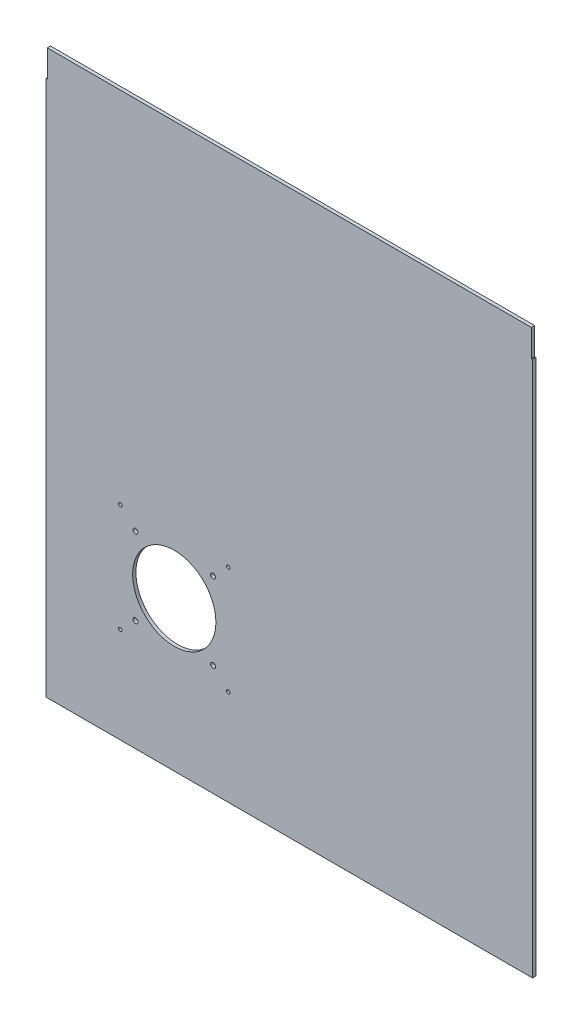
ISO-10303-21;
HEADER;
FILE_DESCRIPTION(('STEP AP214'),'2;1');
FILE_NAME('part.step','',(''),(''),'','','');
FILE_SCHEMA(('AUTOMOTIVE_DESIGN { 1 0 10303 214 1 1 1 1 }'));
ENDSEC;
DATA;
#1=APPLICATION_CONTEXT('core data for automotive mechanical design processes');
#2=APPLICATION_PROTOCOL_DEFINITION('international standard','automotive_design',2000,#1);
#3=PRODUCT_CONTEXT('',#1,'mechanical');
#4=PRODUCT('Part','Part','',(#3));
#5=PRODUCT_RELATED_PRODUCT_CATEGORY('part','',(#4));
#6=PRODUCT_DEFINITION_FORMATION('','',#4);
#7=PRODUCT_DEFINITION_CONTEXT('part definition',#1,'design');
#8=PRODUCT_DEFINITION('design','',#6,#7);
#9=PRODUCT_DEFINITION_SHAPE('','',#8);
#10=(LENGTH_UNIT() NAMED_UNIT(*) SI_UNIT(.MILLI.,.METRE.));
#11=(NAMED_UNIT(*) PLANE_ANGLE_UNIT() SI_UNIT($,.RADIAN.));
#12=(NAMED_UNIT(*) SI_UNIT($,.STERADIAN.) SOLID_ANGLE_UNIT());
#13=UNCERTAINTY_MEASURE_WITH_UNIT(LENGTH_MEASURE(1.E-05),#10,'distance_accuracy_value','');
#14=(GEOMETRIC_REPRESENTATION_CONTEXT(3) GLOBAL_UNCERTAINTY_ASSIGNED_CONTEXT((#13)) GLOBAL_UNIT_ASSIGNED_CONTEXT((#10,
#11,#12)) REPRESENTATION_CONTEXT('',''));
#15=CARTESIAN_POINT('',(0.,0.,0.));
#16=DIRECTION('',(0.,0.,1.));
#17=DIRECTION('',(1.,0.,0.));
#18=AXIS2_PLACEMENT_3D('',#15,#16,#17);
#19=CARTESIAN_POINT('',(187.161325966851,323.703267525864,3.));
#20=DIRECTION('',(-1.,0.,0.));
#21=DIRECTION('',(0.,0.,1.));
#22=AXIS2_PLACEMENT_3D('',#19,#20,#21);
#23=PLANE('',#22);
#24=DIRECTION('',(0.,1.,0.));
#25=VECTOR('',#24,1.);
#26=CARTESIAN_POINT('',(187.161325966851,323.703267525864,0.));
#27=LINE('',#26,#25);
#28=CARTESIAN_POINT('',(187.161325966851,298.703267525864,0.));
#29=VERTEX_POINT('',#28);
#30=CARTESIAN_POINT('',(187.161325966851,323.703267525864,0.));
#31=VERTEX_POINT('',#30);
#32=EDGE_CURVE('E130',#29,#31,#27,.T.);
#33=ORIENTED_EDGE('',*,*,#32,.T.);
#34=DIRECTION('',(0.,0.,-1.));
#35=VECTOR('',#34,1.);
#36=CARTESIAN_POINT('',(187.161325966851,323.703267525864,3.));
#37=LINE('',#36,#35);
#38=CARTESIAN_POINT('',(187.161325966851,323.703267525864,3.));
#39=VERTEX_POINT('',#38);
#40=EDGE_CURVE('E11',#39,#31,#37,.T.);
#41=ORIENTED_EDGE('',*,*,#40,.F.);
#42=DIRECTION('',(0.,1.,0.));
#43=VECTOR('',#42,1.);
#44=CARTESIAN_POINT('',(187.161325966851,323.703267525864,3.));
#45=LINE('',#44,#43);
#46=CARTESIAN_POINT('',(187.161325966851,298.703267525864,3.));
#47=VERTEX_POINT('',#46);
#48=EDGE_CURVE('E145',#47,#39,#45,.T.);
#49=ORIENTED_EDGE('',*,*,#48,.F.);
#50=DIRECTION('',(0.,0.,-1.));
#51=VECTOR('',#50,1.);
#52=CARTESIAN_POINT('',(187.161325966851,298.703267525864,3.));
#53=LINE('',#52,#51);
#54=EDGE_CURVE('E126',#47,#29,#53,.T.);
#55=ORIENTED_EDGE('',*,*,#54,.T.);
#56=EDGE_LOOP('',(#33,#41,#49,#55));
#57=FACE_BOUND('',#56,.T.);
#58=ADVANCED_FACE('F34',(#57),#23,.F.);
#59=CARTESIAN_POINT('',(-260.838674033149,323.703267525864,3.));
#60=DIRECTION('',(0.,-1.,0.));
#61=DIRECTION('',(0.,0.,-1.));
#62=AXIS2_PLACEMENT_3D('',#59,#60,#61);
#63=PLANE('',#62);
#64=DIRECTION('',(-1.,0.,0.));
#65=VECTOR('',#64,1.);
#66=CARTESIAN_POINT('',(-260.838674033149,323.703267525864,0.));
#67=LINE('',#66,#65);
#68=CARTESIAN_POINT('',(-260.838674033149,323.703267525864,0.));
#69=VERTEX_POINT('',#68);
#70=EDGE_CURVE('E133',#31,#69,#67,.T.);
#71=ORIENTED_EDGE('',*,*,#70,.T.);
#72=DIRECTION('',(0.,0.,-1.));
#73=VECTOR('',#72,1.);
#74=CARTESIAN_POINT('',(-260.838674033149,323.703267525864,3.));
#75=LINE('',#74,#73);
#76=CARTESIAN_POINT('',(-260.838674033149,323.703267525864,3.));
#77=VERTEX_POINT('',#76);
#78=EDGE_CURVE('E42',#77,#69,#75,.T.);
#79=ORIENTED_EDGE('',*,*,#78,.F.);
#80=DIRECTION('',(-1.,0.,0.));
#81=VECTOR('',#80,1.);
#82=CARTESIAN_POINT('',(-260.838674033149,323.703267525864,3.));
#83=LINE('',#82,#81);
#84=EDGE_CURVE('E93',#39,#77,#83,.T.);
#85=ORIENTED_EDGE('',*,*,#84,.F.);
#86=ORIENTED_EDGE('',*,*,#40,.T.);
#87=EDGE_LOOP('',(#71,#79,#85,#86));
#88=FACE_BOUND('',#87,.T.);
#89=ADVANCED_FACE('F272',(#88),#63,.F.);
#90=CARTESIAN_POINT('',(-260.838674033149,298.703267525864,3.));
#91=DIRECTION('',(1.,0.,0.));
#92=DIRECTION('',(0.,0.,-1.));
#93=AXIS2_PLACEMENT_3D('',#90,#91,#92);
#94=PLANE('',#93);
#95=DIRECTION('',(0.,-1.,0.));
#96=VECTOR('',#95,1.);
#97=CARTESIAN_POINT('',(-260.838674033149,298.703267525864,0.));
#98=LINE('',#97,#96);
#99=CARTESIAN_POINT('',(-260.838674033149,298.703267525864,0.));
#100=VERTEX_POINT('',#99);
#101=EDGE_CURVE('E136',#69,#100,#98,.T.);
#102=ORIENTED_EDGE('',*,*,#101,.T.);
#103=DIRECTION('',(0.,0.,-1.));
#104=VECTOR('',#103,1.);
#105=CARTESIAN_POINT('',(-260.838674033149,298.703267525864,3.));
#106=LINE('',#105,#104);
#107=CARTESIAN_POINT('',(-260.838674033149,298.703267525864,3.));
#108=VERTEX_POINT('',#107);
#109=EDGE_CURVE('E152',#108,#100,#106,.T.);
#110=ORIENTED_EDGE('',*,*,#109,.F.);
#111=DIRECTION('',(0.,-1.,0.));
#112=VECTOR('',#111,1.);
#113=CARTESIAN_POINT('',(-260.838674033149,298.703267525864,3.));
#114=LINE('',#113,#112);
#115=EDGE_CURVE('E160',#77,#108,#114,.T.);
#116=ORIENTED_EDGE('',*,*,#115,.F.);
#117=ORIENTED_EDGE('',*,*,#78,.T.);
#118=EDGE_LOOP('',(#102,#110,#116,#117));
#119=FACE_BOUND('',#118,.T.);
#120=ADVANCED_FACE('F158',(#119),#94,.F.);
#121=CARTESIAN_POINT('',(-261.838674033149,298.703267525864,3.));
#122=DIRECTION('',(0.,-1.,0.));
#123=DIRECTION('',(0.,0.,-1.));
#124=AXIS2_PLACEMENT_3D('',#121,#122,#123);
#125=PLANE('',#124);
#126=DIRECTION('',(-1.,0.,0.));
#127=VECTOR('',#126,1.);
#128=CARTESIAN_POINT('',(-261.838674033149,298.703267525864,0.));
#129=LINE('',#128,#127);
#130=CARTESIAN_POINT('',(-261.838674033149,298.703267525864,0.));
#131=VERTEX_POINT('',#130);
#132=EDGE_CURVE('E138',#100,#131,#129,.T.);
#133=ORIENTED_EDGE('',*,*,#132,.T.);
#134=DIRECTION('',(0.,0.,-1.));
#135=VECTOR('',#134,1.);
#136=CARTESIAN_POINT('',(-261.838674033149,298.703267525864,3.));
#137=LINE('',#136,#135);
#138=CARTESIAN_POINT('',(-261.838674033149,298.703267525864,3.));
#139=VERTEX_POINT('',#138);
#140=EDGE_CURVE('E149',#139,#131,#137,.T.);
#141=ORIENTED_EDGE('',*,*,#140,.F.);
#142=DIRECTION('',(-1.,0.,0.));
#143=VECTOR('',#142,1.);
#144=CARTESIAN_POINT('',(-261.838674033149,298.703267525864,3.));
#145=LINE('',#144,#143);
#146=EDGE_CURVE('E172',#108,#139,#145,.T.);
#147=ORIENTED_EDGE('',*,*,#146,.F.);
#148=ORIENTED_EDGE('',*,*,#109,.T.);
#149=EDGE_LOOP('',(#133,#141,#147,#148));
#150=FACE_BOUND('',#149,.T.);
#151=ADVANCED_FACE('F168',(#150),#125,.F.);
#152=CARTESIAN_POINT('',(-261.838674033149,298.703267525864,3.));
#153=DIRECTION('',(1.,0.,0.));
#154=DIRECTION('',(0.,1.,0.));
#155=AXIS2_PLACEMENT_3D('',#152,#153,#154);
#156=PLANE('',#155);
#157=DIRECTION('',(0.,-1.,0.));
#158=VECTOR('',#157,1.);
#159=CARTESIAN_POINT('',(-261.838674033149,298.703267525864,0.));
#160=LINE('',#159,#158);
#161=CARTESIAN_POINT('',(-261.838674033149,-197.096732474136,0.));
#162=VERTEX_POINT('',#161);
#163=EDGE_CURVE('E140',#131,#162,#160,.T.);
#164=ORIENTED_EDGE('',*,*,#163,.T.);
#165=DIRECTION('',(0.,0.,-1.));
#166=VECTOR('',#165,1.);
#167=CARTESIAN_POINT('',(-261.838674033149,-197.096732474136,3.));
#168=LINE('',#167,#166);
#169=CARTESIAN_POINT('',(-261.838674033149,-197.096732474136,3.));
#170=VERTEX_POINT('',#169);
#171=EDGE_CURVE('E121',#170,#162,#168,.T.);
#172=ORIENTED_EDGE('',*,*,#171,.F.);
#173=DIRECTION('',(0.,-1.,0.));
#174=VECTOR('',#173,1.);
#175=CARTESIAN_POINT('',(-261.838674033149,298.703267525864,3.));
#176=LINE('',#175,#174);
#177=EDGE_CURVE('E112',#139,#170,#176,.T.);
#178=ORIENTED_EDGE('',*,*,#177,.F.);
#179=ORIENTED_EDGE('',*,*,#140,.T.);
#180=EDGE_LOOP('',(#164,#172,#178,#179));
#181=FACE_BOUND('',#180,.T.);
#182=ADVANCED_FACE('F171',(#181),#156,.F.);
#183=CARTESIAN_POINT('',(-261.838674033149,-197.096732474136,3.));
#184=DIRECTION('',(0.,1.,0.));
#185=DIRECTION('',(0.,0.,1.));
#186=AXIS2_PLACEMENT_3D('',#183,#184,#185);
#187=PLANE('',#186);
#188=DIRECTION('',(1.,0.,0.));
#189=VECTOR('',#188,1.);
#190=CARTESIAN_POINT('',(-261.838674033149,-197.096732474136,0.));
#191=LINE('',#190,#189);
#192=CARTESIAN_POINT('',(188.161325966851,-197.096732474136,0.));
#193=VERTEX_POINT('',#192);
#194=EDGE_CURVE('E120',#162,#193,#191,.T.);
#195=ORIENTED_EDGE('',*,*,#194,.T.);
#196=DIRECTION('',(0.,0.,-1.));
#197=VECTOR('',#196,1.);
#198=CARTESIAN_POINT('',(188.161325966851,-197.096732474136,3.));
#199=LINE('',#198,#197);
#200=CARTESIAN_POINT('',(188.161325966851,-197.096732474136,3.));
#201=VERTEX_POINT('',#200);
#202=EDGE_CURVE('E117',#201,#193,#199,.T.);
#203=ORIENTED_EDGE('',*,*,#202,.F.);
#204=DIRECTION('',(1.,0.,0.));
#205=VECTOR('',#204,1.);
#206=CARTESIAN_POINT('',(-261.838674033149,-197.096732474136,3.));
#207=LINE('',#206,#205);
#208=EDGE_CURVE('E106',#170,#201,#207,.T.);
#209=ORIENTED_EDGE('',*,*,#208,.F.);
#210=ORIENTED_EDGE('',*,*,#171,.T.);
#211=EDGE_LOOP('',(#195,#203,#209,#210));
#212=FACE_BOUND('',#211,.T.);
#213=ADVANCED_FACE('F118',(#212),#187,.F.);
#214=CARTESIAN_POINT('',(188.161325966851,298.703267525864,3.));
#215=DIRECTION('',(-1.,0.,0.));
#216=DIRECTION('',(0.,-1.,0.));
#217=AXIS2_PLACEMENT_3D('',#214,#215,#216);
#218=PLANE('',#217);
#219=DIRECTION('',(0.,1.,0.));
#220=VECTOR('',#219,1.);
#221=CARTESIAN_POINT('',(188.161325966851,298.703267525864,0.));
#222=LINE('',#221,#220);
#223=CARTESIAN_POINT('',(188.161325966851,298.703267525864,0.));
#224=VERTEX_POINT('',#223);
#225=EDGE_CURVE('E79',#193,#224,#222,.T.);
#226=ORIENTED_EDGE('',*,*,#225,.T.);
#227=DIRECTION('',(0.,0.,-1.));
#228=VECTOR('',#227,1.);
#229=CARTESIAN_POINT('',(188.161325966851,298.703267525864,3.));
#230=LINE('',#229,#228);
#231=CARTESIAN_POINT('',(188.161325966851,298.703267525864,3.));
#232=VERTEX_POINT('',#231);
#233=EDGE_CURVE('E122',#232,#224,#230,.T.);
#234=ORIENTED_EDGE('',*,*,#233,.F.);
#235=DIRECTION('',(0.,1.,0.));
#236=VECTOR('',#235,1.);
#237=CARTESIAN_POINT('',(188.161325966851,298.703267525864,3.));
#238=LINE('',#237,#236);
#239=EDGE_CURVE('E110',#201,#232,#238,.T.);
#240=ORIENTED_EDGE('',*,*,#239,.F.);
#241=ORIENTED_EDGE('',*,*,#202,.T.);
#242=EDGE_LOOP('',(#226,#234,#240,#241));
#243=FACE_BOUND('',#242,.T.);
#244=ADVANCED_FACE('F124',(#243),#218,.F.);
#245=CARTESIAN_POINT('',(187.161325966851,298.703267525864,3.));
#246=DIRECTION('',(0.,-1.,0.));
#247=DIRECTION('',(0.,0.,-1.));
#248=AXIS2_PLACEMENT_3D('',#245,#246,#247);
#249=PLANE('',#248);
#250=DIRECTION('',(-1.,0.,0.));
#251=VECTOR('',#250,1.);
#252=CARTESIAN_POINT('',(187.161325966851,298.703267525864,0.));
#253=LINE('',#252,#251);
#254=EDGE_CURVE('E85',#224,#29,#253,.T.);
#255=ORIENTED_EDGE('',*,*,#254,.T.);
#256=ORIENTED_EDGE('',*,*,#54,.F.);
#257=DIRECTION('',(-1.,0.,0.));
#258=VECTOR('',#257,1.);
#259=CARTESIAN_POINT('',(187.161325966851,298.703267525864,3.));
#260=LINE('',#259,#258);
#261=EDGE_CURVE('E50',#232,#47,#260,.T.);
#262=ORIENTED_EDGE('',*,*,#261,.F.);
#263=ORIENTED_EDGE('',*,*,#233,.T.);
#264=EDGE_LOOP('',(#255,#256,#262,#263));
#265=FACE_BOUND('',#264,.T.);
#266=ADVANCED_FACE('F244',(#265),#249,.F.);
#267=CARTESIAN_POINT('',(0.,0.,3.));
#268=DIRECTION('',(0.,0.,1.));
#269=DIRECTION('',(1.,0.,0.));
#270=AXIS2_PLACEMENT_3D('',#267,#268,#269);
#271=PLANE('',#270);
#272=CARTESIAN_POINT('',(-107.488674033149,-22.7467324741361,3.));
#273=DIRECTION('',(0.,0.,1.));
#274=DIRECTION('',(1.,0.,0.));
#275=AXIS2_PLACEMENT_3D('',#272,#273,#274);
#276=CIRCLE('',#275,2.25);
#277=CARTESIAN_POINT('',(-105.238674033149,-22.7467324741361,3.));
#278=VERTEX_POINT('',#277);
#279=EDGE_CURVE('E203',#278,#278,#276,.T.);
#280=ORIENTED_EDGE('',*,*,#279,.F.);
#281=EDGE_LOOP('',(#280));
#282=FACE_BOUND('',#281,.T.);
#283=CARTESIAN_POINT('',(-107.488674033148,-94.4467324741362,3.));
#284=DIRECTION('',(0.,0.,1.));
#285=DIRECTION('',(1.,0.,0.));
#286=AXIS2_PLACEMENT_3D('',#283,#284,#285);
#287=CIRCLE('',#286,2.24999999999999);
#288=CARTESIAN_POINT('',(-105.238674033148,-94.4467324741362,3.));
#289=VERTEX_POINT('',#288);
#290=EDGE_CURVE('E197',#289,#289,#287,.T.);
#291=ORIENTED_EDGE('',*,*,#290,.F.);
#292=EDGE_LOOP('',(#291));
#293=FACE_BOUND('',#292,.T.);
#294=CARTESIAN_POINT('',(-179.188674033148,-94.4467324741369,3.));
#295=DIRECTION('',(0.,0.,1.));
#296=DIRECTION('',(1.,0.,0.));
#297=AXIS2_PLACEMENT_3D('',#294,#295,#296);
#298=CIRCLE('',#297,2.25000000000001);
#299=CARTESIAN_POINT('',(-176.938674033148,-94.4467324741369,3.));
#300=VERTEX_POINT('',#299);
#301=EDGE_CURVE('E191',#300,#300,#298,.T.);
#302=ORIENTED_EDGE('',*,*,#301,.F.);
#303=EDGE_LOOP('',(#302));
#304=FACE_BOUND('',#303,.T.);
#305=CARTESIAN_POINT('',(-179.188674033149,-22.7467324741367,3.));
#306=DIRECTION('',(0.,0.,1.));
#307=DIRECTION('',(1.,0.,0.));
#308=AXIS2_PLACEMENT_3D('',#305,#306,#307);
#309=CIRCLE('',#308,2.24999999999999);
#310=CARTESIAN_POINT('',(-176.938674033149,-22.7467324741367,3.));
#311=VERTEX_POINT('',#310);
#312=EDGE_CURVE('E184',#311,#311,#309,.T.);
#313=ORIENTED_EDGE('',*,*,#312,.F.);
#314=EDGE_LOOP('',(#313));
#315=FACE_BOUND('',#314,.T.);
#316=CARTESIAN_POINT('',(-93.338674033149,-8.59673247413611,3.));
#317=DIRECTION('',(0.,0.,1.));
#318=DIRECTION('',(1.,0.,0.));
#319=AXIS2_PLACEMENT_3D('',#316,#317,#318);
#320=CIRCLE('',#319,1.6);
#321=CARTESIAN_POINT('',(-91.738674033149,-8.59673247413611,3.));
#322=VERTEX_POINT('',#321);
#323=EDGE_CURVE('E226',#322,#322,#320,.T.);
#324=ORIENTED_EDGE('',*,*,#323,.F.);
#325=EDGE_LOOP('',(#324));
#326=FACE_BOUND('',#325,.T.);
#327=CARTESIAN_POINT('',(-93.3386740331479,-108.596732474136,3.));
#328=DIRECTION('',(0.,0.,1.));
#329=DIRECTION('',(1.,0.,0.));
#330=AXIS2_PLACEMENT_3D('',#327,#328,#329);
#331=CIRCLE('',#330,1.6);
#332=CARTESIAN_POINT('',(-91.7386740331479,-108.596732474136,3.));
#333=VERTEX_POINT('',#332);
#334=EDGE_CURVE('E220',#333,#333,#331,.T.);
#335=ORIENTED_EDGE('',*,*,#334,.F.);
#336=EDGE_LOOP('',(#335));
#337=FACE_BOUND('',#336,.T.);
#338=CARTESIAN_POINT('',(-193.338674033148,-108.596732474137,3.));
#339=DIRECTION('',(0.,0.,1.));
#340=DIRECTION('',(1.,0.,0.));
#341=AXIS2_PLACEMENT_3D('',#338,#339,#340);
#342=CIRCLE('',#341,1.60000000000002);
#343=CARTESIAN_POINT('',(-191.738674033148,-108.596732474137,3.));
#344=VERTEX_POINT('',#343);
#345=EDGE_CURVE('E214',#344,#344,#342,.T.);
#346=ORIENTED_EDGE('',*,*,#345,.F.);
#347=EDGE_LOOP('',(#346));
#348=FACE_BOUND('',#347,.T.);
#349=CARTESIAN_POINT('',(-193.338674033149,-8.59673247413692,3.));
#350=DIRECTION('',(0.,0.,1.));
#351=DIRECTION('',(1.,0.,0.));
#352=AXIS2_PLACEMENT_3D('',#349,#350,#351);
#353=CIRCLE('',#352,1.59999999999999);
#354=CARTESIAN_POINT('',(-191.738674033149,-8.59673247413692,3.));
#355=VERTEX_POINT('',#354);
#356=EDGE_CURVE('E208',#355,#355,#353,.T.);
#357=ORIENTED_EDGE('',*,*,#356,.F.);
#358=EDGE_LOOP('',(#357));
#359=FACE_BOUND('',#358,.T.);
#360=CARTESIAN_POINT('',(-143.338674033149,-58.5967324741361,3.));
#361=DIRECTION('',(0.,0.,1.));
#362=DIRECTION('',(1.,0.,0.));
#363=AXIS2_PLACEMENT_3D('',#360,#361,#362);
#364=CIRCLE('',#363,38.5);
#365=CARTESIAN_POINT('',(-104.838674033149,-58.5967324741361,3.));
#366=VERTEX_POINT('',#365);
#367=EDGE_CURVE('E178',#366,#366,#364,.T.);
#368=ORIENTED_EDGE('',*,*,#367,.F.);
#369=EDGE_LOOP('',(#368));
#370=FACE_BOUND('',#369,.T.);
#371=ORIENTED_EDGE('',*,*,#48,.T.);
#372=ORIENTED_EDGE('',*,*,#84,.T.);
#373=ORIENTED_EDGE('',*,*,#115,.T.);
#374=ORIENTED_EDGE('',*,*,#146,.T.);
#375=ORIENTED_EDGE('',*,*,#177,.T.);
#376=ORIENTED_EDGE('',*,*,#208,.T.);
#377=ORIENTED_EDGE('',*,*,#239,.T.);
#378=ORIENTED_EDGE('',*,*,#261,.T.);
#379=EDGE_LOOP('',(#371,#372,#373,#374,#375,#376,#377,#378));
#380=FACE_BOUND('',#379,.T.);
#381=ADVANCED_FACE('F108',(#282,#293,#304,#315,#326,#337,#348,#359,#370,#380),#271,.T.);
#382=CARTESIAN_POINT('',(0.,0.,0.));
#383=DIRECTION('',(0.,0.,1.));
#384=DIRECTION('',(1.,0.,0.));
#385=AXIS2_PLACEMENT_3D('',#382,#383,#384);
#386=PLANE('',#385);
#387=CARTESIAN_POINT('',(-107.488674033149,-22.7467324741361,0.));
#388=DIRECTION('',(0.,0.,1.));
#389=DIRECTION('',(1.,0.,0.));
#390=AXIS2_PLACEMENT_3D('',#387,#388,#389);
#391=CIRCLE('',#390,2.25);
#392=CARTESIAN_POINT('',(-105.238674033149,-22.7467324741361,0.));
#393=VERTEX_POINT('',#392);
#394=EDGE_CURVE('E181',#393,#393,#391,.T.);
#395=ORIENTED_EDGE('',*,*,#394,.T.);
#396=EDGE_LOOP('',(#395));
#397=FACE_BOUND('',#396,.T.);
#398=CARTESIAN_POINT('',(-107.488674033148,-94.4467324741362,0.));
#399=DIRECTION('',(0.,0.,1.));
#400=DIRECTION('',(1.,0.,0.));
#401=AXIS2_PLACEMENT_3D('',#398,#399,#400);
#402=CIRCLE('',#401,2.24999999999999);
#403=CARTESIAN_POINT('',(-105.238674033148,-94.4467324741362,0.));
#404=VERTEX_POINT('',#403);
#405=EDGE_CURVE('E200',#404,#404,#402,.T.);
#406=ORIENTED_EDGE('',*,*,#405,.T.);
#407=EDGE_LOOP('',(#406));
#408=FACE_BOUND('',#407,.T.);
#409=CARTESIAN_POINT('',(-179.188674033148,-94.4467324741369,0.));
#410=DIRECTION('',(0.,0.,1.));
#411=DIRECTION('',(1.,0.,0.));
#412=AXIS2_PLACEMENT_3D('',#409,#410,#411);
#413=CIRCLE('',#412,2.25000000000001);
#414=CARTESIAN_POINT('',(-176.938674033148,-94.4467324741369,0.));
#415=VERTEX_POINT('',#414);
#416=EDGE_CURVE('E194',#415,#415,#413,.T.);
#417=ORIENTED_EDGE('',*,*,#416,.T.);
#418=EDGE_LOOP('',(#417));
#419=FACE_BOUND('',#418,.T.);
#420=CARTESIAN_POINT('',(-179.188674033149,-22.7467324741367,0.));
#421=DIRECTION('',(0.,0.,1.));
#422=DIRECTION('',(1.,0.,0.));
#423=AXIS2_PLACEMENT_3D('',#420,#421,#422);
#424=CIRCLE('',#423,2.24999999999999);
#425=CARTESIAN_POINT('',(-176.938674033149,-22.7467324741367,0.));
#426=VERTEX_POINT('',#425);
#427=EDGE_CURVE('E187',#426,#426,#424,.T.);
#428=ORIENTED_EDGE('',*,*,#427,.T.);
#429=EDGE_LOOP('',(#428));
#430=FACE_BOUND('',#429,.T.);
#431=CARTESIAN_POINT('',(-93.338674033149,-8.59673247413611,0.));
#432=DIRECTION('',(0.,0.,1.));
#433=DIRECTION('',(1.,0.,0.));
#434=AXIS2_PLACEMENT_3D('',#431,#432,#433);
#435=CIRCLE('',#434,1.6);
#436=CARTESIAN_POINT('',(-91.738674033149,-8.59673247413611,0.));
#437=VERTEX_POINT('',#436);
#438=EDGE_CURVE('E188',#437,#437,#435,.T.);
#439=ORIENTED_EDGE('',*,*,#438,.T.);
#440=EDGE_LOOP('',(#439));
#441=FACE_BOUND('',#440,.T.);
#442=CARTESIAN_POINT('',(-93.3386740331479,-108.596732474136,0.));
#443=DIRECTION('',(0.,0.,1.));
#444=DIRECTION('',(1.,0.,0.));
#445=AXIS2_PLACEMENT_3D('',#442,#443,#444);
#446=CIRCLE('',#445,1.6);
#447=CARTESIAN_POINT('',(-91.7386740331479,-108.596732474136,0.));
#448=VERTEX_POINT('',#447);
#449=EDGE_CURVE('E223',#448,#448,#446,.T.);
#450=ORIENTED_EDGE('',*,*,#449,.T.);
#451=EDGE_LOOP('',(#450));
#452=FACE_BOUND('',#451,.T.);
#453=CARTESIAN_POINT('',(-193.338674033148,-108.596732474137,0.));
#454=DIRECTION('',(0.,0.,1.));
#455=DIRECTION('',(1.,0.,0.));
#456=AXIS2_PLACEMENT_3D('',#453,#454,#455);
#457=CIRCLE('',#456,1.60000000000002);
#458=CARTESIAN_POINT('',(-191.738674033148,-108.596732474137,0.));
#459=VERTEX_POINT('',#458);
#460=EDGE_CURVE('E217',#459,#459,#457,.T.);
#461=ORIENTED_EDGE('',*,*,#460,.T.);
#462=EDGE_LOOP('',(#461));
#463=FACE_BOUND('',#462,.T.);
#464=CARTESIAN_POINT('',(-193.338674033149,-8.59673247413692,0.));
#465=DIRECTION('',(0.,0.,1.));
#466=DIRECTION('',(1.,0.,0.));
#467=AXIS2_PLACEMENT_3D('',#464,#465,#466);
#468=CIRCLE('',#467,1.59999999999999);
#469=CARTESIAN_POINT('',(-191.738674033149,-8.59673247413692,0.));
#470=VERTEX_POINT('',#469);
#471=EDGE_CURVE('E211',#470,#470,#468,.T.);
#472=ORIENTED_EDGE('',*,*,#471,.T.);
#473=EDGE_LOOP('',(#472));
#474=FACE_BOUND('',#473,.T.);
#475=CARTESIAN_POINT('',(-143.338674033149,-58.5967324741361,0.));
#476=DIRECTION('',(0.,0.,1.));
#477=DIRECTION('',(1.,0.,0.));
#478=AXIS2_PLACEMENT_3D('',#475,#476,#477);
#479=CIRCLE('',#478,38.5);
#480=CARTESIAN_POINT('',(-104.838674033149,-58.5967324741361,0.));
#481=VERTEX_POINT('',#480);
#482=EDGE_CURVE('E134',#481,#481,#479,.T.);
#483=ORIENTED_EDGE('',*,*,#482,.T.);
#484=EDGE_LOOP('',(#483));
#485=FACE_BOUND('',#484,.T.);
#486=ORIENTED_EDGE('',*,*,#32,.F.);
#487=ORIENTED_EDGE('',*,*,#254,.F.);
#488=ORIENTED_EDGE('',*,*,#225,.F.);
#489=ORIENTED_EDGE('',*,*,#194,.F.);
#490=ORIENTED_EDGE('',*,*,#163,.F.);
#491=ORIENTED_EDGE('',*,*,#132,.F.);
#492=ORIENTED_EDGE('',*,*,#101,.F.);
#493=ORIENTED_EDGE('',*,*,#70,.F.);
#494=EDGE_LOOP('',(#486,#487,#488,#489,#490,#491,#492,#493));
#495=FACE_BOUND('',#494,.T.);
#496=ADVANCED_FACE('F164',(#397,#408,#419,#430,#441,#452,#463,#474,#485,#495),#386,.F.);
#497=CARTESIAN_POINT('',(-143.338674033149,-58.5967324741361,0.));
#498=DIRECTION('',(0.,0.,1.));
#499=DIRECTION('',(1.,0.,0.));
#500=AXIS2_PLACEMENT_3D('',#497,#498,#499);
#501=CYLINDRICAL_SURFACE('',#500,38.5);
#502=ORIENTED_EDGE('',*,*,#482,.F.);
#503=EDGE_LOOP('',(#502));
#504=FACE_BOUND('',#503,.T.);
#505=ORIENTED_EDGE('',*,*,#367,.T.);
#506=EDGE_LOOP('',(#505));
#507=FACE_BOUND('',#506,.T.);
#508=ADVANCED_FACE('F255',(#504,#507),#501,.F.);
#509=CARTESIAN_POINT('',(-193.338674033149,-8.59673247413692,0.));
#510=DIRECTION('',(0.,0.,1.));
#511=DIRECTION('',(1.,0.,0.));
#512=AXIS2_PLACEMENT_3D('',#509,#510,#511);
#513=CYLINDRICAL_SURFACE('',#512,1.59999999999999);
#514=ORIENTED_EDGE('',*,*,#471,.F.);
#515=EDGE_LOOP('',(#514));
#516=FACE_BOUND('',#515,.T.);
#517=ORIENTED_EDGE('',*,*,#356,.T.);
#518=EDGE_LOOP('',(#517));
#519=FACE_BOUND('',#518,.T.);
#520=ADVANCED_FACE('F257',(#516,#519),#513,.F.);
#521=CARTESIAN_POINT('',(-193.338674033148,-108.596732474137,0.));
#522=DIRECTION('',(0.,0.,1.));
#523=DIRECTION('',(1.,0.,0.));
#524=AXIS2_PLACEMENT_3D('',#521,#522,#523);
#525=CYLINDRICAL_SURFACE('',#524,1.60000000000002);
#526=ORIENTED_EDGE('',*,*,#460,.F.);
#527=EDGE_LOOP('',(#526));
#528=FACE_BOUND('',#527,.T.);
#529=ORIENTED_EDGE('',*,*,#345,.T.);
#530=EDGE_LOOP('',(#529));
#531=FACE_BOUND('',#530,.T.);
#532=ADVANCED_FACE('F264',(#528,#531),#525,.F.);
#533=CARTESIAN_POINT('',(-93.3386740331479,-108.596732474136,0.));
#534=DIRECTION('',(0.,0.,1.));
#535=DIRECTION('',(1.,0.,0.));
#536=AXIS2_PLACEMENT_3D('',#533,#534,#535);
#537=CYLINDRICAL_SURFACE('',#536,1.6);
#538=ORIENTED_EDGE('',*,*,#449,.F.);
#539=EDGE_LOOP('',(#538));
#540=FACE_BOUND('',#539,.T.);
#541=ORIENTED_EDGE('',*,*,#334,.T.);
#542=EDGE_LOOP('',(#541));
#543=FACE_BOUND('',#542,.T.);
#544=ADVANCED_FACE('F238',(#540,#543),#537,.F.);
#545=CARTESIAN_POINT('',(-93.338674033149,-8.59673247413611,0.));
#546=DIRECTION('',(0.,0.,1.));
#547=DIRECTION('',(1.,0.,0.));
#548=AXIS2_PLACEMENT_3D('',#545,#546,#547);
#549=CYLINDRICAL_SURFACE('',#548,1.6);
#550=ORIENTED_EDGE('',*,*,#438,.F.);
#551=EDGE_LOOP('',(#550));
#552=FACE_BOUND('',#551,.T.);
#553=ORIENTED_EDGE('',*,*,#323,.T.);
#554=EDGE_LOOP('',(#553));
#555=FACE_BOUND('',#554,.T.);
#556=ADVANCED_FACE('F234',(#552,#555),#549,.F.);
#557=CARTESIAN_POINT('',(-179.188674033149,-22.7467324741367,0.));
#558=DIRECTION('',(0.,0.,1.));
#559=DIRECTION('',(1.,0.,0.));
#560=AXIS2_PLACEMENT_3D('',#557,#558,#559);
#561=CYLINDRICAL_SURFACE('',#560,2.24999999999999);
#562=ORIENTED_EDGE('',*,*,#427,.F.);
#563=EDGE_LOOP('',(#562));
#564=FACE_BOUND('',#563,.T.);
#565=ORIENTED_EDGE('',*,*,#312,.T.);
#566=EDGE_LOOP('',(#565));
#567=FACE_BOUND('',#566,.T.);
#568=ADVANCED_FACE('F237',(#564,#567),#561,.F.);
#569=CARTESIAN_POINT('',(-179.188674033148,-94.4467324741369,0.));
#570=DIRECTION('',(0.,0.,1.));
#571=DIRECTION('',(1.,0.,0.));
#572=AXIS2_PLACEMENT_3D('',#569,#570,#571);
#573=CYLINDRICAL_SURFACE('',#572,2.25000000000001);
#574=ORIENTED_EDGE('',*,*,#416,.F.);
#575=EDGE_LOOP('',(#574));
#576=FACE_BOUND('',#575,.T.);
#577=ORIENTED_EDGE('',*,*,#301,.T.);
#578=EDGE_LOOP('',(#577));
#579=FACE_BOUND('',#578,.T.);
#580=ADVANCED_FACE('F366',(#576,#579),#573,.F.);
#581=CARTESIAN_POINT('',(-107.488674033148,-94.4467324741362,0.));
#582=DIRECTION('',(0.,0.,1.));
#583=DIRECTION('',(1.,0.,0.));
#584=AXIS2_PLACEMENT_3D('',#581,#582,#583);
#585=CYLINDRICAL_SURFACE('',#584,2.24999999999999);
#586=ORIENTED_EDGE('',*,*,#405,.F.);
#587=EDGE_LOOP('',(#586));
#588=FACE_BOUND('',#587,.T.);
#589=ORIENTED_EDGE('',*,*,#290,.T.);
#590=EDGE_LOOP('',(#589));
#591=FACE_BOUND('',#590,.T.);
#592=ADVANCED_FACE('F375',(#588,#591),#585,.F.);
#593=CARTESIAN_POINT('',(-107.488674033149,-22.7467324741361,0.));
#594=DIRECTION('',(0.,0.,1.));
#595=DIRECTION('',(1.,0.,0.));
#596=AXIS2_PLACEMENT_3D('',#593,#594,#595);
#597=CYLINDRICAL_SURFACE('',#596,2.25);
#598=ORIENTED_EDGE('',*,*,#394,.F.);
#599=EDGE_LOOP('',(#598));
#600=FACE_BOUND('',#599,.T.);
#601=ORIENTED_EDGE('',*,*,#279,.T.);
#602=EDGE_LOOP('',(#601));
#603=FACE_BOUND('',#602,.T.);
#604=ADVANCED_FACE('F385',(#600,#603),#597,.F.);
#605=CLOSED_SHELL('',(#58,#89,#120,#151,#182,#213,#244,#266,#381,#496,#508,#520,#532,#544,#556,
#568,#580,#592,#604));
#606=MANIFOLD_SOLID_BREP('B2',#605);
#607=ADVANCED_BREP_SHAPE_REPRESENTATION('',(#18,#606),#14);
#608=SHAPE_DEFINITION_REPRESENTATION(#9,#607);
ENDSEC;
END-ISO-10303-21;
